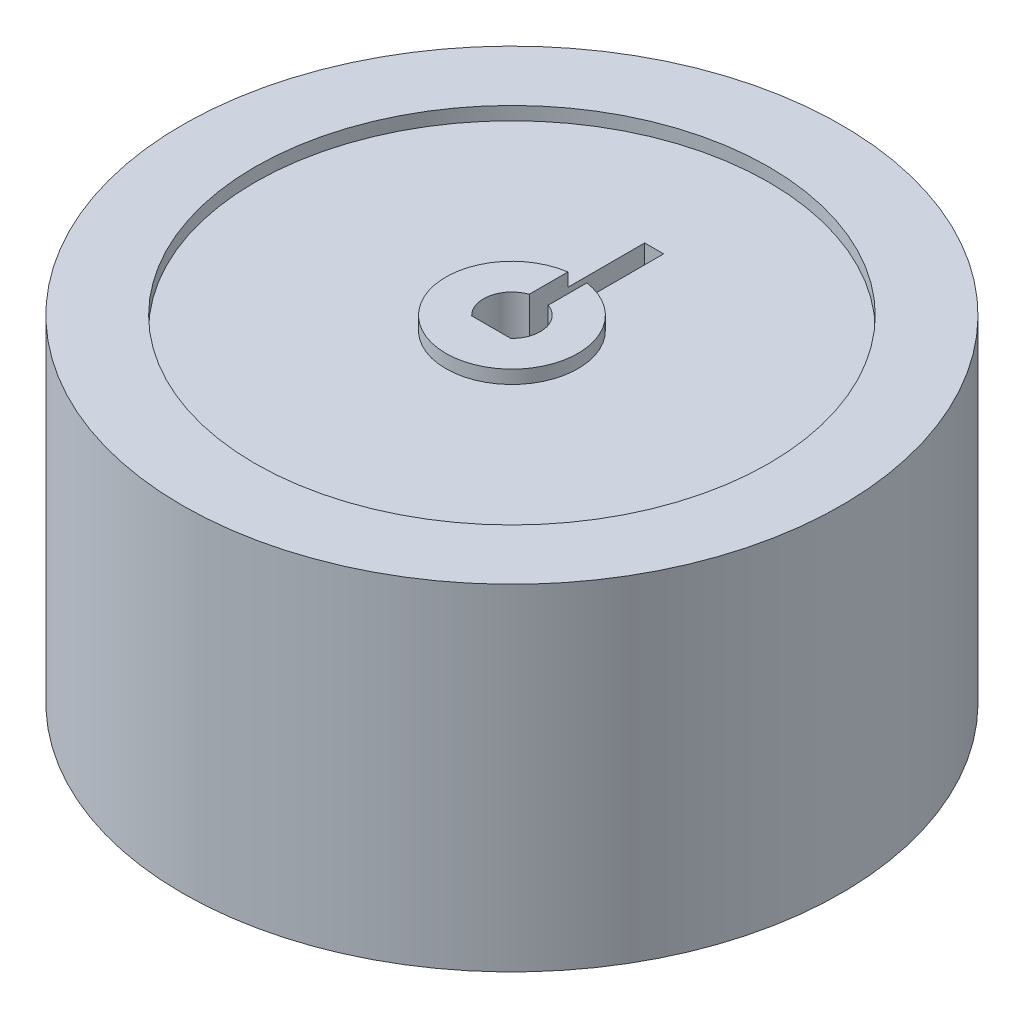
ISO-10303-21;
HEADER;
FILE_DESCRIPTION(('STEP AP214'),'2;1');
FILE_NAME('part.step','',(''),(''),'','','');
FILE_SCHEMA(('AUTOMOTIVE_DESIGN { 1 0 10303 214 1 1 1 1 }'));
ENDSEC;
DATA;
#1=APPLICATION_CONTEXT('core data for automotive mechanical design processes');
#2=APPLICATION_PROTOCOL_DEFINITION('international standard','automotive_design',2000,#1);
#3=PRODUCT_CONTEXT('',#1,'mechanical');
#4=PRODUCT('Part','Part','',(#3));
#5=PRODUCT_RELATED_PRODUCT_CATEGORY('part','',(#4));
#6=PRODUCT_DEFINITION_FORMATION('','',#4);
#7=PRODUCT_DEFINITION_CONTEXT('part definition',#1,'design');
#8=PRODUCT_DEFINITION('design','',#6,#7);
#9=PRODUCT_DEFINITION_SHAPE('','',#8);
#10=(LENGTH_UNIT() NAMED_UNIT(*) SI_UNIT(.MILLI.,.METRE.));
#11=(NAMED_UNIT(*) PLANE_ANGLE_UNIT() SI_UNIT($,.RADIAN.));
#12=(NAMED_UNIT(*) SI_UNIT($,.STERADIAN.) SOLID_ANGLE_UNIT());
#13=UNCERTAINTY_MEASURE_WITH_UNIT(LENGTH_MEASURE(1.E-05),#10,'distance_accuracy_value','');
#14=(GEOMETRIC_REPRESENTATION_CONTEXT(3) GLOBAL_UNCERTAINTY_ASSIGNED_CONTEXT((#13)) GLOBAL_UNIT_ASSIGNED_CONTEXT((#10,
#11,#12)) REPRESENTATION_CONTEXT('',''));
#15=CARTESIAN_POINT('',(0.,0.,0.));
#16=DIRECTION('',(0.,0.,1.));
#17=DIRECTION('',(1.,0.,0.));
#18=AXIS2_PLACEMENT_3D('',#15,#16,#17);
#19=CARTESIAN_POINT('',(0.,-3.96334454722271,0.));
#20=DIRECTION('',(0.,1.,0.));
#21=DIRECTION('',(0.,0.,1.));
#22=AXIS2_PLACEMENT_3D('',#19,#20,#21);
#23=CYLINDRICAL_SURFACE('',#22,1.5);
#24=CARTESIAN_POINT('',(0.,17.7,0.));
#25=DIRECTION('',(0.,1.,0.));
#26=DIRECTION('',(0.,0.,-1.));
#27=AXIS2_PLACEMENT_3D('',#24,#25,#26);
#28=CIRCLE('',#27,1.5);
#29=CARTESIAN_POINT('',(1.03048532255438,17.7,1.09));
#30=VERTEX_POINT('',#29);
#31=CARTESIAN_POINT('',(0.5,17.7,-1.4142135623731));
#32=VERTEX_POINT('',#31);
#33=EDGE_CURVE('E124',#30,#32,#28,.T.);
#34=ORIENTED_EDGE('',*,*,#33,.T.);
#35=DIRECTION('',(0.,1.,0.));
#36=VECTOR('',#35,1.);
#37=CARTESIAN_POINT('',(0.5,-6.1673978762849,-1.4142135623731));
#38=LINE('',#37,#36);
#39=CARTESIAN_POINT('',(0.5,0.,-1.4142135623731));
#40=VERTEX_POINT('',#39);
#41=EDGE_CURVE('E106',#40,#32,#38,.T.);
#42=ORIENTED_EDGE('',*,*,#41,.F.);
#43=CARTESIAN_POINT('',(0.,0.,0.));
#44=DIRECTION('',(0.,1.,0.));
#45=DIRECTION('',(0.,0.,1.));
#46=AXIS2_PLACEMENT_3D('',#43,#44,#45);
#47=CIRCLE('',#46,1.5);
#48=CARTESIAN_POINT('',(1.03048532255438,0.,1.09));
#49=VERTEX_POINT('',#48);
#50=EDGE_CURVE('E66',#40,#49,#47,.F.);
#51=ORIENTED_EDGE('',*,*,#50,.T.);
#52=DIRECTION('',(0.,1.,0.));
#53=VECTOR('',#52,1.);
#54=CARTESIAN_POINT('',(1.03048532255438,-3.96334454722271,1.09));
#55=LINE('',#54,#53);
#56=EDGE_CURVE('E129',#49,#30,#55,.T.);
#57=ORIENTED_EDGE('',*,*,#56,.T.);
#58=EDGE_LOOP('',(#34,#42,#51,#57));
#59=FACE_BOUND('',#58,.T.);
#60=ADVANCED_FACE('F42',(#59),#23,.F.);
#61=CARTESIAN_POINT('',(0.,17.7,0.));
#62=DIRECTION('',(0.,-1.,0.));
#63=DIRECTION('',(0.,0.,-1.));
#64=AXIS2_PLACEMENT_3D('',#61,#62,#63);
#65=CYLINDRICAL_SURFACE('',#64,17.375);
#66=CARTESIAN_POINT('',(0.,17.7,0.));
#67=DIRECTION('',(0.,1.,0.));
#68=DIRECTION('',(0.,0.,1.));
#69=AXIS2_PLACEMENT_3D('',#66,#67,#68);
#70=CIRCLE('',#69,17.375);
#71=CARTESIAN_POINT('',(0.,17.7,17.375));
#72=VERTEX_POINT('',#71);
#73=EDGE_CURVE('E51',#72,#72,#70,.T.);
#74=ORIENTED_EDGE('',*,*,#73,.F.);
#75=EDGE_LOOP('',(#74));
#76=FACE_BOUND('',#75,.T.);
#77=CARTESIAN_POINT('',(0.,0.,0.));
#78=DIRECTION('',(0.,1.,0.));
#79=DIRECTION('',(0.,0.,1.));
#80=AXIS2_PLACEMENT_3D('',#77,#78,#79);
#81=CIRCLE('',#80,17.375);
#82=CARTESIAN_POINT('',(0.,0.,17.375));
#83=VERTEX_POINT('',#82);
#84=EDGE_CURVE('E163',#83,#83,#81,.T.);
#85=ORIENTED_EDGE('',*,*,#84,.T.);
#86=EDGE_LOOP('',(#85));
#87=FACE_BOUND('',#86,.T.);
#88=ADVANCED_FACE('F44',(#76,#87),#65,.T.);
#89=CARTESIAN_POINT('',(0.,17.7,0.));
#90=DIRECTION('',(0.,1.,0.));
#91=DIRECTION('',(0.,0.,1.));
#92=AXIS2_PLACEMENT_3D('',#89,#90,#91);
#93=PLANE('',#92);
#94=CARTESIAN_POINT('',(0.,17.7,0.));
#95=DIRECTION('',(0.,1.,0.));
#96=DIRECTION('',(0.,0.,1.));
#97=AXIS2_PLACEMENT_3D('',#94,#95,#96);
#98=CIRCLE('',#97,13.545);
#99=CARTESIAN_POINT('',(0.,17.7,13.545));
#100=VERTEX_POINT('',#99);
#101=EDGE_CURVE('E155',#100,#100,#98,.T.);
#102=ORIENTED_EDGE('',*,*,#101,.F.);
#103=EDGE_LOOP('',(#102));
#104=FACE_BOUND('',#103,.T.);
#105=ORIENTED_EDGE('',*,*,#73,.T.);
#106=EDGE_LOOP('',(#105));
#107=FACE_BOUND('',#106,.T.);
#108=ADVANCED_FACE('F177',(#104,#107),#93,.T.);
#109=CARTESIAN_POINT('',(0.,0.,0.));
#110=DIRECTION('',(0.,1.,0.));
#111=DIRECTION('',(0.,0.,1.));
#112=AXIS2_PLACEMENT_3D('',#109,#110,#111);
#113=PLANE('',#112);
#114=DIRECTION('',(1.,0.,0.));
#115=VECTOR('',#114,1.);
#116=CARTESIAN_POINT('',(-0.5,0.,-7.5));
#117=LINE('',#116,#115);
#118=CARTESIAN_POINT('',(-0.5,0.,-7.5));
#119=VERTEX_POINT('',#118);
#120=CARTESIAN_POINT('',(0.5,0.,-7.5));
#121=VERTEX_POINT('',#120);
#122=EDGE_CURVE('E217',#119,#121,#117,.T.);
#123=ORIENTED_EDGE('',*,*,#122,.F.);
#124=DIRECTION('',(0.,0.,-1.));
#125=VECTOR('',#124,1.);
#126=CARTESIAN_POINT('',(-0.5,0.,-7.5));
#127=LINE('',#126,#125);
#128=CARTESIAN_POINT('',(-0.5,0.,-1.4142135623731));
#129=VERTEX_POINT('',#128);
#130=EDGE_CURVE('E216',#129,#119,#127,.T.);
#131=ORIENTED_EDGE('',*,*,#130,.F.);
#132=CARTESIAN_POINT('',(-1.03048532255438,0.,1.09));
#133=VERTEX_POINT('',#132);
#134=EDGE_CURVE('E141',#133,#129,#47,.F.);
#135=ORIENTED_EDGE('',*,*,#134,.F.);
#136=DIRECTION('',(-1.,0.,0.));
#137=VECTOR('',#136,1.);
#138=CARTESIAN_POINT('',(-1.03048532255438,0.,1.09));
#139=LINE('',#138,#137);
#140=EDGE_CURVE('E149',#49,#133,#139,.T.);
#141=ORIENTED_EDGE('',*,*,#140,.F.);
#142=ORIENTED_EDGE('',*,*,#50,.F.);
#143=DIRECTION('',(0.,0.,1.));
#144=VECTOR('',#143,1.);
#145=CARTESIAN_POINT('',(0.5,0.,-7.5));
#146=LINE('',#145,#144);
#147=EDGE_CURVE('E113',#121,#40,#146,.T.);
#148=ORIENTED_EDGE('',*,*,#147,.F.);
#149=EDGE_LOOP('',(#123,#131,#135,#141,#142,#148));
#150=FACE_BOUND('',#149,.T.);
#151=ORIENTED_EDGE('',*,*,#84,.F.);
#152=EDGE_LOOP('',(#151));
#153=FACE_BOUND('',#152,.T.);
#154=ADVANCED_FACE('F174',(#150,#153),#113,.F.);
#155=CARTESIAN_POINT('',(0.,17.,0.));
#156=DIRECTION('',(0.,1.,0.));
#157=DIRECTION('',(0.,0.,1.));
#158=AXIS2_PLACEMENT_3D('',#155,#156,#157);
#159=CYLINDRICAL_SURFACE('',#158,13.545);
#160=CARTESIAN_POINT('',(0.,17.,0.));
#161=DIRECTION('',(0.,1.,0.));
#162=DIRECTION('',(0.,0.,1.));
#163=AXIS2_PLACEMENT_3D('',#160,#161,#162);
#164=CIRCLE('',#163,13.545);
#165=CARTESIAN_POINT('',(0.,17.,13.545));
#166=VERTEX_POINT('',#165);
#167=EDGE_CURVE('E159',#166,#166,#164,.T.);
#168=ORIENTED_EDGE('',*,*,#167,.F.);
#169=EDGE_LOOP('',(#168));
#170=FACE_BOUND('',#169,.T.);
#171=ORIENTED_EDGE('',*,*,#101,.T.);
#172=EDGE_LOOP('',(#171));
#173=FACE_BOUND('',#172,.T.);
#174=ADVANCED_FACE('F176',(#170,#173),#159,.F.);
#175=CARTESIAN_POINT('',(0.,17.,0.));
#176=DIRECTION('',(0.,1.,0.));
#177=DIRECTION('',(0.,0.,1.));
#178=AXIS2_PLACEMENT_3D('',#175,#176,#177);
#179=PLANE('',#178);
#180=DIRECTION('',(0.,0.,1.));
#181=VECTOR('',#180,1.);
#182=CARTESIAN_POINT('',(-0.5,17.,0.));
#183=LINE('',#182,#181);
#184=CARTESIAN_POINT('',(-0.5,17.,-7.5));
#185=VERTEX_POINT('',#184);
#186=CARTESIAN_POINT('',(-0.5,17.,-3.44894549101606));
#187=VERTEX_POINT('',#186);
#188=EDGE_CURVE('E139',#185,#187,#183,.T.);
#189=ORIENTED_EDGE('',*,*,#188,.F.);
#190=DIRECTION('',(-1.,0.,0.));
#191=VECTOR('',#190,1.);
#192=CARTESIAN_POINT('',(0.,17.,-7.5));
#193=LINE('',#192,#191);
#194=CARTESIAN_POINT('',(0.5,17.,-7.5));
#195=VERTEX_POINT('',#194);
#196=EDGE_CURVE('E11',#195,#185,#193,.T.);
#197=ORIENTED_EDGE('',*,*,#196,.F.);
#198=DIRECTION('',(0.,0.,-1.));
#199=VECTOR('',#198,1.);
#200=CARTESIAN_POINT('',(0.5,17.,0.));
#201=LINE('',#200,#199);
#202=CARTESIAN_POINT('',(0.5,17.,-3.44894549101606));
#203=VERTEX_POINT('',#202);
#204=EDGE_CURVE('E225',#203,#195,#201,.T.);
#205=ORIENTED_EDGE('',*,*,#204,.F.);
#206=CARTESIAN_POINT('',(0.,17.,0.));
#207=DIRECTION('',(0.,1.,0.));
#208=DIRECTION('',(0.,0.,1.));
#209=AXIS2_PLACEMENT_3D('',#206,#207,#208);
#210=CIRCLE('',#209,3.485);
#211=EDGE_CURVE('E152',#187,#203,#210,.T.);
#212=ORIENTED_EDGE('',*,*,#211,.F.);
#213=EDGE_LOOP('',(#189,#197,#205,#212));
#214=FACE_BOUND('',#213,.T.);
#215=ORIENTED_EDGE('',*,*,#167,.T.);
#216=EDGE_LOOP('',(#215));
#217=FACE_BOUND('',#216,.T.);
#218=ADVANCED_FACE('F183',(#214,#217),#179,.T.);
#219=CARTESIAN_POINT('',(0.,17.7,0.));
#220=DIRECTION('',(0.,-1.,0.));
#221=DIRECTION('',(0.,0.,-1.));
#222=AXIS2_PLACEMENT_3D('',#219,#220,#221);
#223=CYLINDRICAL_SURFACE('',#222,3.485);
#224=CARTESIAN_POINT('',(0.,17.7,0.));
#225=DIRECTION('',(0.,1.,0.));
#226=DIRECTION('',(0.,0.,1.));
#227=AXIS2_PLACEMENT_3D('',#224,#225,#226);
#228=CIRCLE('',#227,3.485);
#229=CARTESIAN_POINT('',(-0.5,17.7,-3.44894549101606));
#230=VERTEX_POINT('',#229);
#231=CARTESIAN_POINT('',(0.5,17.7,-3.44894549101606));
#232=VERTEX_POINT('',#231);
#233=EDGE_CURVE('E126',#230,#232,#228,.T.);
#234=ORIENTED_EDGE('',*,*,#233,.F.);
#235=DIRECTION('',(0.,-1.,0.));
#236=VECTOR('',#235,1.);
#237=CARTESIAN_POINT('',(-0.5,17.7,-3.44894549101606));
#238=LINE('',#237,#236);
#239=EDGE_CURVE('E242',#230,#187,#238,.T.);
#240=ORIENTED_EDGE('',*,*,#239,.T.);
#241=ORIENTED_EDGE('',*,*,#211,.T.);
#242=DIRECTION('',(0.,-1.,0.));
#243=VECTOR('',#242,1.);
#244=CARTESIAN_POINT('',(0.5,17.7,-3.44894549101606));
#245=LINE('',#244,#243);
#246=EDGE_CURVE('E221',#203,#232,#245,.F.);
#247=ORIENTED_EDGE('',*,*,#246,.T.);
#248=EDGE_LOOP('',(#234,#240,#241,#247));
#249=FACE_BOUND('',#248,.T.);
#250=ADVANCED_FACE('F207',(#249),#223,.T.);
#251=CARTESIAN_POINT('',(0.,17.7,0.));
#252=DIRECTION('',(0.,1.,0.));
#253=DIRECTION('',(0.,0.,1.));
#254=AXIS2_PLACEMENT_3D('',#251,#252,#253);
#255=PLANE('',#254);
#256=DIRECTION('',(0.,0.,1.));
#257=VECTOR('',#256,1.);
#258=CARTESIAN_POINT('',(-0.5,17.7,-7.5));
#259=LINE('',#258,#257);
#260=CARTESIAN_POINT('',(-0.5,17.7,-1.4142135623731));
#261=VERTEX_POINT('',#260);
#262=EDGE_CURVE('E58',#230,#261,#259,.T.);
#263=ORIENTED_EDGE('',*,*,#262,.F.);
#264=ORIENTED_EDGE('',*,*,#233,.T.);
#265=DIRECTION('',(0.,0.,-1.));
#266=VECTOR('',#265,1.);
#267=CARTESIAN_POINT('',(0.5,17.7,-7.5));
#268=LINE('',#267,#266);
#269=EDGE_CURVE('E109',#32,#232,#268,.T.);
#270=ORIENTED_EDGE('',*,*,#269,.F.);
#271=ORIENTED_EDGE('',*,*,#33,.F.);
#272=DIRECTION('',(1.,0.,0.));
#273=VECTOR('',#272,1.);
#274=CARTESIAN_POINT('',(-1.03048532255438,17.7,1.09));
#275=LINE('',#274,#273);
#276=CARTESIAN_POINT('',(-1.03048532255438,17.7,1.09));
#277=VERTEX_POINT('',#276);
#278=EDGE_CURVE('E132',#277,#30,#275,.T.);
#279=ORIENTED_EDGE('',*,*,#278,.F.);
#280=EDGE_CURVE('E133',#261,#277,#28,.T.);
#281=ORIENTED_EDGE('',*,*,#280,.F.);
#282=EDGE_LOOP('',(#263,#264,#270,#271,#279,#281));
#283=FACE_BOUND('',#282,.T.);
#284=ADVANCED_FACE('F122',(#283),#255,.T.);
#285=ORIENTED_EDGE('',*,*,#134,.T.);
#286=DIRECTION('',(0.,1.,0.));
#287=VECTOR('',#286,1.);
#288=CARTESIAN_POINT('',(-0.5,-6.1673978762849,-1.4142135623731));
#289=LINE('',#288,#287);
#290=EDGE_CURVE('E117',#129,#261,#289,.T.);
#291=ORIENTED_EDGE('',*,*,#290,.T.);
#292=ORIENTED_EDGE('',*,*,#280,.T.);
#293=DIRECTION('',(0.,1.,0.));
#294=VECTOR('',#293,1.);
#295=CARTESIAN_POINT('',(-1.03048532255438,-3.96334454722271,1.09));
#296=LINE('',#295,#294);
#297=EDGE_CURVE('E137',#133,#277,#296,.T.);
#298=ORIENTED_EDGE('',*,*,#297,.F.);
#299=EDGE_LOOP('',(#285,#291,#292,#298));
#300=FACE_BOUND('',#299,.T.);
#301=ADVANCED_FACE('F191',(#300),#23,.F.);
#302=CARTESIAN_POINT('',(-1.03048532255438,-3.96334454722271,1.09));
#303=DIRECTION('',(0.,0.,1.));
#304=DIRECTION('',(1.,0.,0.));
#305=AXIS2_PLACEMENT_3D('',#302,#303,#304);
#306=PLANE('',#305);
#307=ORIENTED_EDGE('',*,*,#140,.T.);
#308=ORIENTED_EDGE('',*,*,#297,.T.);
#309=ORIENTED_EDGE('',*,*,#278,.T.);
#310=ORIENTED_EDGE('',*,*,#56,.F.);
#311=EDGE_LOOP('',(#307,#308,#309,#310));
#312=FACE_BOUND('',#311,.T.);
#313=ADVANCED_FACE('F199',(#312),#306,.F.);
#314=CARTESIAN_POINT('',(-0.5,-6.1673978762849,-7.5));
#315=DIRECTION('',(-1.,0.,0.));
#316=DIRECTION('',(0.,0.,1.));
#317=AXIS2_PLACEMENT_3D('',#314,#315,#316);
#318=PLANE('',#317);
#319=ORIENTED_EDGE('',*,*,#188,.T.);
#320=ORIENTED_EDGE('',*,*,#239,.F.);
#321=ORIENTED_EDGE('',*,*,#262,.T.);
#322=ORIENTED_EDGE('',*,*,#290,.F.);
#323=ORIENTED_EDGE('',*,*,#130,.T.);
#324=DIRECTION('',(0.,1.,0.));
#325=VECTOR('',#324,1.);
#326=CARTESIAN_POINT('',(-0.5,-6.1673978762849,-7.5));
#327=LINE('',#326,#325);
#328=EDGE_CURVE('E232',#119,#185,#327,.T.);
#329=ORIENTED_EDGE('',*,*,#328,.T.);
#330=EDGE_LOOP('',(#319,#320,#321,#322,#323,#329));
#331=FACE_BOUND('',#330,.T.);
#332=ADVANCED_FACE('F205',(#331),#318,.F.);
#333=CARTESIAN_POINT('',(-0.5,-6.1673978762849,-7.5));
#334=DIRECTION('',(0.,0.,-1.));
#335=DIRECTION('',(-1.,0.,0.));
#336=AXIS2_PLACEMENT_3D('',#333,#334,#335);
#337=PLANE('',#336);
#338=ORIENTED_EDGE('',*,*,#196,.T.);
#339=ORIENTED_EDGE('',*,*,#328,.F.);
#340=ORIENTED_EDGE('',*,*,#122,.T.);
#341=DIRECTION('',(0.,1.,0.));
#342=VECTOR('',#341,1.);
#343=CARTESIAN_POINT('',(0.5,-6.1673978762849,-7.5));
#344=LINE('',#343,#342);
#345=EDGE_CURVE('E116',#121,#195,#344,.T.);
#346=ORIENTED_EDGE('',*,*,#345,.T.);
#347=EDGE_LOOP('',(#338,#339,#340,#346));
#348=FACE_BOUND('',#347,.T.);
#349=ADVANCED_FACE('F254',(#348),#337,.F.);
#350=CARTESIAN_POINT('',(0.5,-6.1673978762849,-7.5));
#351=DIRECTION('',(1.,0.,0.));
#352=DIRECTION('',(0.,0.,-1.));
#353=AXIS2_PLACEMENT_3D('',#350,#351,#352);
#354=PLANE('',#353);
#355=ORIENTED_EDGE('',*,*,#204,.T.);
#356=ORIENTED_EDGE('',*,*,#345,.F.);
#357=ORIENTED_EDGE('',*,*,#147,.T.);
#358=ORIENTED_EDGE('',*,*,#41,.T.);
#359=ORIENTED_EDGE('',*,*,#269,.T.);
#360=ORIENTED_EDGE('',*,*,#246,.F.);
#361=EDGE_LOOP('',(#355,#356,#357,#358,#359,#360));
#362=FACE_BOUND('',#361,.T.);
#363=ADVANCED_FACE('F108',(#362),#354,.F.);
#364=CLOSED_SHELL('',(#60,#88,#108,#154,#174,#218,#250,#284,#301,#313,#332,#349,#363));
#365=MANIFOLD_SOLID_BREP('B2',#364);
#366=ADVANCED_BREP_SHAPE_REPRESENTATION('',(#18,#365),#14);
#367=SHAPE_DEFINITION_REPRESENTATION(#9,#366);
ENDSEC;
END-ISO-10303-21;
